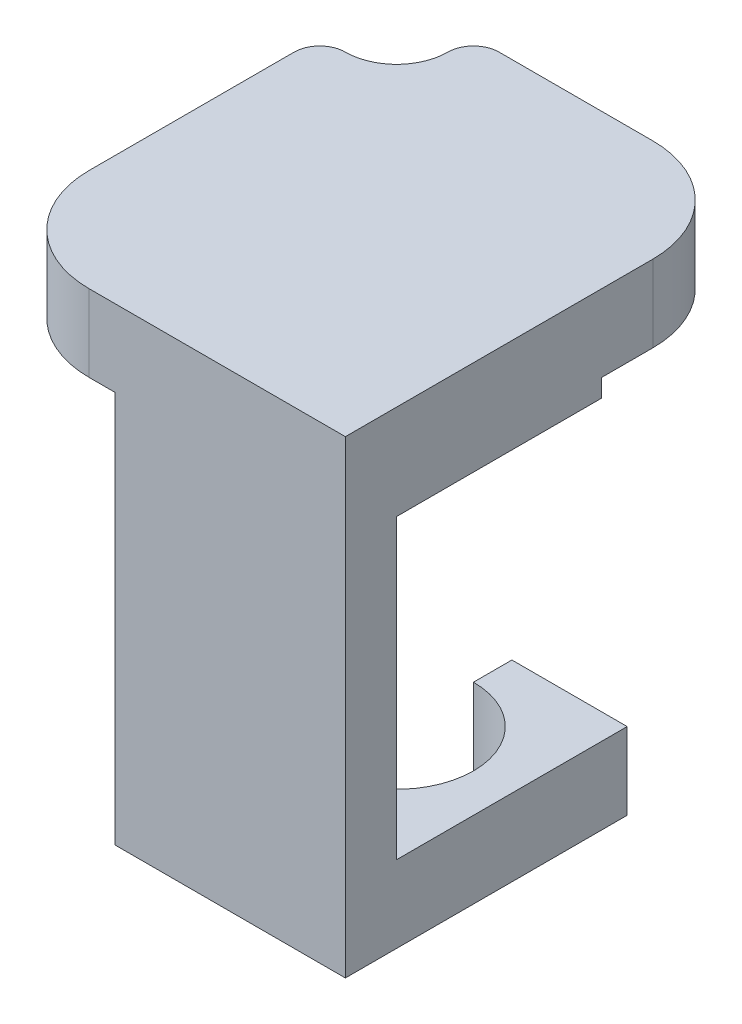
ISO-10303-21;
HEADER;
FILE_DESCRIPTION(('STEP AP214'),'2;1');
FILE_NAME('part.step','',(''),(''),'','','');
FILE_SCHEMA(('AUTOMOTIVE_DESIGN { 1 0 10303 214 1 1 1 1 }'));
ENDSEC;
DATA;
#1=APPLICATION_CONTEXT('core data for automotive mechanical design processes');
#2=APPLICATION_PROTOCOL_DEFINITION('international standard','automotive_design',2000,#1);
#3=PRODUCT_CONTEXT('',#1,'mechanical');
#4=PRODUCT('Part','Part','',(#3));
#5=PRODUCT_RELATED_PRODUCT_CATEGORY('part','',(#4));
#6=PRODUCT_DEFINITION_FORMATION('','',#4);
#7=PRODUCT_DEFINITION_CONTEXT('part definition',#1,'design');
#8=PRODUCT_DEFINITION('design','',#6,#7);
#9=PRODUCT_DEFINITION_SHAPE('','',#8);
#10=(LENGTH_UNIT() NAMED_UNIT(*) SI_UNIT(.MILLI.,.METRE.));
#11=(NAMED_UNIT(*) PLANE_ANGLE_UNIT() SI_UNIT($,.RADIAN.));
#12=(NAMED_UNIT(*) SI_UNIT($,.STERADIAN.) SOLID_ANGLE_UNIT());
#13=UNCERTAINTY_MEASURE_WITH_UNIT(LENGTH_MEASURE(1.E-05),#10,'distance_accuracy_value','');
#14=(GEOMETRIC_REPRESENTATION_CONTEXT(3) GLOBAL_UNCERTAINTY_ASSIGNED_CONTEXT((#13)) GLOBAL_UNIT_ASSIGNED_CONTEXT((#10,
#11,#12)) REPRESENTATION_CONTEXT('',''));
#15=CARTESIAN_POINT('',(0.,0.,0.));
#16=DIRECTION('',(0.,0.,1.));
#17=DIRECTION('',(1.,0.,0.));
#18=AXIS2_PLACEMENT_3D('',#15,#16,#17);
#19=CARTESIAN_POINT('',(0.,0.,-5.28410471378163));
#20=DIRECTION('',(0.,0.,-1.));
#21=DIRECTION('',(-1.,0.,0.));
#22=AXIS2_PLACEMENT_3D('',#19,#20,#21);
#23=PLANE('',#22);
#24=DIRECTION('',(0.,-1.,0.));
#25=VECTOR('',#24,1.);
#26=CARTESIAN_POINT('',(-13.3528439453228,-3.,-5.28410471378163));
#27=LINE('',#26,#25);
#28=CARTESIAN_POINT('',(-13.3528439453228,11.5999999999993,-5.28410471378163));
#29=VERTEX_POINT('',#28);
#30=CARTESIAN_POINT('',(-13.3528439453228,0.,-5.28410471378163));
#31=VERTEX_POINT('',#30);
#32=EDGE_CURVE('E254',#29,#31,#27,.T.);
#33=ORIENTED_EDGE('',*,*,#32,.F.);
#34=DIRECTION('',(-1.,0.,0.));
#35=VECTOR('',#34,1.);
#36=CARTESIAN_POINT('',(-4.35284394532278,11.5999999999993,-5.28410471378163));
#37=LINE('',#36,#35);
#38=CARTESIAN_POINT('',(-4.35284394532278,11.5999999999993,-5.28410471378163));
#39=VERTEX_POINT('',#38);
#40=EDGE_CURVE('E239',#39,#29,#37,.T.);
#41=ORIENTED_EDGE('',*,*,#40,.F.);
#42=DIRECTION('',(0.,1.,0.));
#43=VECTOR('',#42,1.);
#44=CARTESIAN_POINT('',(-4.35284394532278,-3.,-5.28410471378163));
#45=LINE('',#44,#43);
#46=CARTESIAN_POINT('',(-4.35284394532278,0.,-5.28410471378163));
#47=VERTEX_POINT('',#46);
#48=EDGE_CURVE('E259',#47,#39,#45,.T.);
#49=ORIENTED_EDGE('',*,*,#48,.F.);
#50=DIRECTION('',(1.,0.,0.));
#51=VECTOR('',#50,1.);
#52=CARTESIAN_POINT('',(-13.3528439453228,0.,-5.28410471378163));
#53=LINE('',#52,#51);
#54=EDGE_CURVE('E401',#31,#47,#53,.T.);
#55=ORIENTED_EDGE('',*,*,#54,.F.);
#56=EDGE_LOOP('',(#33,#41,#49,#55));
#57=FACE_BOUND('',#56,.T.);
#58=ADVANCED_FACE('F35',(#57),#23,.T.);
#59=CARTESIAN_POINT('',(-4.35284394532278,-3.,-14.2841047137816));
#60=DIRECTION('',(1.,0.,0.));
#61=DIRECTION('',(0.,0.,-1.));
#62=AXIS2_PLACEMENT_3D('',#59,#60,#61);
#63=PLANE('',#62);
#64=DIRECTION('',(0.,0.,-1.));
#65=VECTOR('',#64,1.);
#66=CARTESIAN_POINT('',(-4.35284394532278,12.3,-19.2841047137816));
#67=LINE('',#66,#65);
#68=CARTESIAN_POINT('',(-4.35284394532278,12.3,-13.2841047137816));
#69=VERTEX_POINT('',#68);
#70=CARTESIAN_POINT('',(-4.35284394532278,12.3,-15.2841047137816));
#71=VERTEX_POINT('',#70);
#72=EDGE_CURVE('E221',#69,#71,#67,.T.);
#73=ORIENTED_EDGE('',*,*,#72,.T.);
#74=DIRECTION('',(0.,1.,0.));
#75=VECTOR('',#74,1.);
#76=CARTESIAN_POINT('',(-4.35284394532278,-3.,-15.2841047137816));
#77=LINE('',#76,#75);
#78=CARTESIAN_POINT('',(-4.35284394532278,15.3,-15.2841047137816));
#79=VERTEX_POINT('',#78);
#80=EDGE_CURVE('E280',#71,#79,#77,.T.);
#81=ORIENTED_EDGE('',*,*,#80,.T.);
#82=DIRECTION('',(0.,0.,-1.));
#83=VECTOR('',#82,1.);
#84=CARTESIAN_POINT('',(-4.35284394532278,15.3,-3.28410471378163));
#85=LINE('',#84,#83);
#86=CARTESIAN_POINT('',(-4.35284394532278,15.3,-3.28410471378163));
#87=VERTEX_POINT('',#86);
#88=EDGE_CURVE('E267',#87,#79,#85,.T.);
#89=ORIENTED_EDGE('',*,*,#88,.F.);
#90=DIRECTION('',(0.,1.,0.));
#91=VECTOR('',#90,1.);
#92=CARTESIAN_POINT('',(-4.35284394532278,-3.,-3.28410471378163));
#93=LINE('',#92,#91);
#94=CARTESIAN_POINT('',(-4.35284394532278,-3.,-3.28410471378163));
#95=VERTEX_POINT('',#94);
#96=EDGE_CURVE('E261',#95,#87,#93,.T.);
#97=ORIENTED_EDGE('',*,*,#96,.F.);
#98=DIRECTION('',(0.,0.,-1.));
#99=VECTOR('',#98,1.);
#100=CARTESIAN_POINT('',(-4.35284394532278,-3.,-14.2841047137816));
#101=LINE('',#100,#99);
#102=CARTESIAN_POINT('',(-4.35284394532278,-3.,-14.2841047137816));
#103=VERTEX_POINT('',#102);
#104=EDGE_CURVE('E397',#95,#103,#101,.T.);
#105=ORIENTED_EDGE('',*,*,#104,.T.);
#106=DIRECTION('',(0.,1.,0.));
#107=VECTOR('',#106,1.);
#108=CARTESIAN_POINT('',(-4.35284394532278,-3.,-14.2841047137816));
#109=LINE('',#108,#107);
#110=CARTESIAN_POINT('',(-4.35284394532278,0.,-14.2841047137816));
#111=VERTEX_POINT('',#110);
#112=EDGE_CURVE('E281',#103,#111,#109,.T.);
#113=ORIENTED_EDGE('',*,*,#112,.T.);
#114=DIRECTION('',(0.,0.,-1.));
#115=VECTOR('',#114,1.);
#116=CARTESIAN_POINT('',(-4.35284394532278,0.,-14.2841047137816));
#117=LINE('',#116,#115);
#118=EDGE_CURVE('E389',#47,#111,#117,.T.);
#119=ORIENTED_EDGE('',*,*,#118,.F.);
#120=ORIENTED_EDGE('',*,*,#48,.T.);
#121=DIRECTION('',(0.,0.,1.));
#122=VECTOR('',#121,1.);
#123=CARTESIAN_POINT('',(-4.35284394532278,11.5999999999993,-13.2841047137816));
#124=LINE('',#123,#122);
#125=CARTESIAN_POINT('',(-4.35284394532278,11.5999999999993,-13.2841047137816));
#126=VERTEX_POINT('',#125);
#127=EDGE_CURVE('E252',#126,#39,#124,.T.);
#128=ORIENTED_EDGE('',*,*,#127,.F.);
#129=DIRECTION('',(0.,-1.,0.));
#130=VECTOR('',#129,1.);
#131=CARTESIAN_POINT('',(-4.35284394532278,15.3,-13.2841047137816));
#132=LINE('',#131,#130);
#133=EDGE_CURVE('E240',#69,#126,#132,.T.);
#134=ORIENTED_EDGE('',*,*,#133,.F.);
#135=EDGE_LOOP('',(#73,#81,#89,#97,#105,#113,#119,#120,#128,#134));
#136=FACE_BOUND('',#135,.T.);
#137=ADVANCED_FACE('F353',(#136),#63,.T.);
#138=CARTESIAN_POINT('',(-13.3528439453228,-3.,-14.2841047137816));
#139=DIRECTION('',(-1.,0.,0.));
#140=DIRECTION('',(0.,0.,1.));
#141=AXIS2_PLACEMENT_3D('',#138,#139,#140);
#142=PLANE('',#141);
#143=DIRECTION('',(0.,0.,1.));
#144=VECTOR('',#143,1.);
#145=CARTESIAN_POINT('',(-13.3528439453228,12.3,-14.2841047137816));
#146=LINE('',#145,#144);
#147=CARTESIAN_POINT('',(-13.3528439453228,12.3,-13.2841047137816));
#148=VERTEX_POINT('',#147);
#149=CARTESIAN_POINT('',(-13.3528439453228,12.3,-3.28410471378163));
#150=VERTEX_POINT('',#149);
#151=EDGE_CURVE('E202',#148,#150,#146,.T.);
#152=ORIENTED_EDGE('',*,*,#151,.F.);
#153=DIRECTION('',(0.,-1.,0.));
#154=VECTOR('',#153,1.);
#155=CARTESIAN_POINT('',(-13.3528439453228,15.3,-13.2841047137816));
#156=LINE('',#155,#154);
#157=CARTESIAN_POINT('',(-13.3528439453228,11.5999999999993,-13.2841047137816));
#158=VERTEX_POINT('',#157);
#159=EDGE_CURVE('E245',#148,#158,#156,.T.);
#160=ORIENTED_EDGE('',*,*,#159,.T.);
#161=DIRECTION('',(0.,0.,1.));
#162=VECTOR('',#161,1.);
#163=CARTESIAN_POINT('',(-13.3528439453228,11.5999999999993,-13.2841047137816));
#164=LINE('',#163,#162);
#165=EDGE_CURVE('E248',#158,#29,#164,.T.);
#166=ORIENTED_EDGE('',*,*,#165,.T.);
#167=ORIENTED_EDGE('',*,*,#32,.T.);
#168=DIRECTION('',(0.,0.,1.));
#169=VECTOR('',#168,1.);
#170=CARTESIAN_POINT('',(-13.3528439453228,0.,-14.2841047137816));
#171=LINE('',#170,#169);
#172=CARTESIAN_POINT('',(-13.3528439453228,0.,-9.78410471378163));
#173=VERTEX_POINT('',#172);
#174=EDGE_CURVE('E409',#173,#31,#171,.T.);
#175=ORIENTED_EDGE('',*,*,#174,.F.);
#176=DIRECTION('',(0.,-1.,0.));
#177=VECTOR('',#176,1.);
#178=CARTESIAN_POINT('',(-13.3528439453228,0.,-9.78410471378163));
#179=LINE('',#178,#177);
#180=CARTESIAN_POINT('',(-13.3528439453228,-3.,-9.78410471378163));
#181=VERTEX_POINT('',#180);
#182=EDGE_CURVE('E393',#173,#181,#179,.T.);
#183=ORIENTED_EDGE('',*,*,#182,.T.);
#184=DIRECTION('',(0.,0.,1.));
#185=VECTOR('',#184,1.);
#186=CARTESIAN_POINT('',(-13.3528439453228,-3.,-14.2841047137816));
#187=LINE('',#186,#185);
#188=CARTESIAN_POINT('',(-13.3528439453228,-3.,-3.28410471378163));
#189=VERTEX_POINT('',#188);
#190=EDGE_CURVE('E404',#181,#189,#187,.T.);
#191=ORIENTED_EDGE('',*,*,#190,.T.);
#192=DIRECTION('',(0.,-1.,0.));
#193=VECTOR('',#192,1.);
#194=CARTESIAN_POINT('',(-13.3528439453228,-3.,-3.28410471378163));
#195=LINE('',#194,#193);
#196=EDGE_CURVE('E255',#150,#189,#195,.T.);
#197=ORIENTED_EDGE('',*,*,#196,.F.);
#198=EDGE_LOOP('',(#152,#160,#166,#167,#175,#183,#191,#197));
#199=FACE_BOUND('',#198,.T.);
#200=ADVANCED_FACE('F363',(#199),#142,.T.);
#201=CARTESIAN_POINT('',(-13.3528439453228,-3.,-14.2841047137816));
#202=DIRECTION('',(0.,0.,-1.));
#203=DIRECTION('',(-1.,0.,0.));
#204=AXIS2_PLACEMENT_3D('',#201,#202,#203);
#205=PLANE('',#204);
#206=DIRECTION('',(0.,-1.,0.));
#207=VECTOR('',#206,1.);
#208=CARTESIAN_POINT('',(-8.85284394532278,0.,-14.2841047137816));
#209=LINE('',#208,#207);
#210=CARTESIAN_POINT('',(-8.85284394532278,0.,-14.2841047137816));
#211=VERTEX_POINT('',#210);
#212=CARTESIAN_POINT('',(-8.85284394532278,-3.,-14.2841047137816));
#213=VERTEX_POINT('',#212);
#214=EDGE_CURVE('E390',#211,#213,#209,.T.);
#215=ORIENTED_EDGE('',*,*,#214,.F.);
#216=DIRECTION('',(-1.,0.,0.));
#217=VECTOR('',#216,1.);
#218=CARTESIAN_POINT('',(-13.3528439453228,0.,-14.2841047137816));
#219=LINE('',#218,#217);
#220=EDGE_CURVE('E406',#111,#211,#219,.T.);
#221=ORIENTED_EDGE('',*,*,#220,.F.);
#222=ORIENTED_EDGE('',*,*,#112,.F.);
#223=DIRECTION('',(-1.,0.,0.));
#224=VECTOR('',#223,1.);
#225=CARTESIAN_POINT('',(-13.3528439453228,-3.,-14.2841047137816));
#226=LINE('',#225,#224);
#227=EDGE_CURVE('E400',#103,#213,#226,.T.);
#228=ORIENTED_EDGE('',*,*,#227,.T.);
#229=EDGE_LOOP('',(#215,#221,#222,#228));
#230=FACE_BOUND('',#229,.T.);
#231=ADVANCED_FACE('F434',(#230),#205,.T.);
#232=CARTESIAN_POINT('',(0.,-3.,0.));
#233=DIRECTION('',(0.,1.,0.));
#234=DIRECTION('',(0.,0.,1.));
#235=AXIS2_PLACEMENT_3D('',#232,#233,#234);
#236=PLANE('',#235);
#237=CARTESIAN_POINT('',(-8.85284394532278,-3.,-9.78410471378163));
#238=DIRECTION('',(0.,-1.,0.));
#239=DIRECTION('',(0.,0.,-1.));
#240=AXIS2_PLACEMENT_3D('',#237,#238,#239);
#241=CIRCLE('',#240,3.);
#242=CARTESIAN_POINT('',(-8.85284394532278,-3.,-12.7841047137816));
#243=VERTEX_POINT('',#242);
#244=CARTESIAN_POINT('',(-11.8528439453228,-3.,-9.78410471378163));
#245=VERTEX_POINT('',#244);
#246=EDGE_CURVE('E368',#243,#245,#241,.T.);
#247=ORIENTED_EDGE('',*,*,#246,.F.);
#248=DIRECTION('',(0.,0.,1.));
#249=VECTOR('',#248,1.);
#250=CARTESIAN_POINT('',(-8.85284394532278,-3.,-12.7841047137816));
#251=LINE('',#250,#249);
#252=EDGE_CURVE('E378',#213,#243,#251,.T.);
#253=ORIENTED_EDGE('',*,*,#252,.F.);
#254=ORIENTED_EDGE('',*,*,#227,.F.);
#255=ORIENTED_EDGE('',*,*,#104,.F.);
#256=DIRECTION('',(1.,0.,0.));
#257=VECTOR('',#256,1.);
#258=CARTESIAN_POINT('',(-13.3528439453228,-3.,-3.28410471378163));
#259=LINE('',#258,#257);
#260=EDGE_CURVE('E258',#189,#95,#259,.T.);
#261=ORIENTED_EDGE('',*,*,#260,.F.);
#262=ORIENTED_EDGE('',*,*,#190,.F.);
#263=DIRECTION('',(-1.,0.,0.));
#264=VECTOR('',#263,1.);
#265=CARTESIAN_POINT('',(-13.3528439453228,-3.,-9.78410471378163));
#266=LINE('',#265,#264);
#267=EDGE_CURVE('E370',#245,#181,#266,.T.);
#268=ORIENTED_EDGE('',*,*,#267,.F.);
#269=EDGE_LOOP('',(#247,#253,#254,#255,#261,#262,#268));
#270=FACE_BOUND('',#269,.T.);
#271=ADVANCED_FACE('F446',(#270),#236,.F.);
#272=CARTESIAN_POINT('',(0.,0.,0.));
#273=DIRECTION('',(0.,1.,0.));
#274=DIRECTION('',(0.,0.,1.));
#275=AXIS2_PLACEMENT_3D('',#272,#273,#274);
#276=PLANE('',#275);
#277=DIRECTION('',(0.,0.,1.));
#278=VECTOR('',#277,1.);
#279=CARTESIAN_POINT('',(-8.85284394532278,0.,-12.7841047137816));
#280=LINE('',#279,#278);
#281=CARTESIAN_POINT('',(-8.85284394532278,0.,-12.7841047137816));
#282=VERTEX_POINT('',#281);
#283=EDGE_CURVE('E380',#211,#282,#280,.T.);
#284=ORIENTED_EDGE('',*,*,#283,.T.);
#285=CARTESIAN_POINT('',(-8.85284394532278,0.,-9.78410471378163));
#286=DIRECTION('',(0.,-1.,0.));
#287=DIRECTION('',(0.,0.,-1.));
#288=AXIS2_PLACEMENT_3D('',#285,#286,#287);
#289=CIRCLE('',#288,3.);
#290=CARTESIAN_POINT('',(-11.8528439453228,0.,-9.78410471378163));
#291=VERTEX_POINT('',#290);
#292=EDGE_CURVE('E374',#282,#291,#289,.T.);
#293=ORIENTED_EDGE('',*,*,#292,.T.);
#294=DIRECTION('',(-1.,0.,0.));
#295=VECTOR('',#294,1.);
#296=CARTESIAN_POINT('',(-13.3528439453228,0.,-9.78410471378163));
#297=LINE('',#296,#295);
#298=EDGE_CURVE('E377',#291,#173,#297,.T.);
#299=ORIENTED_EDGE('',*,*,#298,.T.);
#300=ORIENTED_EDGE('',*,*,#174,.T.);
#301=ORIENTED_EDGE('',*,*,#54,.T.);
#302=ORIENTED_EDGE('',*,*,#118,.T.);
#303=ORIENTED_EDGE('',*,*,#220,.T.);
#304=EDGE_LOOP('',(#284,#293,#299,#300,#301,#302,#303));
#305=FACE_BOUND('',#304,.T.);
#306=ADVANCED_FACE('F420',(#305),#276,.T.);
#307=CARTESIAN_POINT('',(-8.85284394532278,0.,-9.78410471378163));
#308=DIRECTION('',(0.,-1.,0.));
#309=DIRECTION('',(0.,0.,-1.));
#310=AXIS2_PLACEMENT_3D('',#307,#308,#309);
#311=CYLINDRICAL_SURFACE('',#310,3.);
#312=ORIENTED_EDGE('',*,*,#246,.T.);
#313=DIRECTION('',(0.,-1.,0.));
#314=VECTOR('',#313,1.);
#315=CARTESIAN_POINT('',(-11.8528439453228,0.,-9.78410471378163));
#316=LINE('',#315,#314);
#317=EDGE_CURVE('E382',#291,#245,#316,.T.);
#318=ORIENTED_EDGE('',*,*,#317,.F.);
#319=ORIENTED_EDGE('',*,*,#292,.F.);
#320=DIRECTION('',(0.,-1.,0.));
#321=VECTOR('',#320,1.);
#322=CARTESIAN_POINT('',(-8.85284394532278,0.,-12.7841047137816));
#323=LINE('',#322,#321);
#324=EDGE_CURVE('E387',#282,#243,#323,.T.);
#325=ORIENTED_EDGE('',*,*,#324,.T.);
#326=EDGE_LOOP('',(#312,#318,#319,#325));
#327=FACE_BOUND('',#326,.T.);
#328=ADVANCED_FACE('F440',(#327),#311,.F.);
#329=CARTESIAN_POINT('',(-8.85284394532278,0.,-12.7841047137816));
#330=DIRECTION('',(1.,0.,0.));
#331=DIRECTION('',(0.,0.,-1.));
#332=AXIS2_PLACEMENT_3D('',#329,#330,#331);
#333=PLANE('',#332);
#334=ORIENTED_EDGE('',*,*,#252,.T.);
#335=ORIENTED_EDGE('',*,*,#324,.F.);
#336=ORIENTED_EDGE('',*,*,#283,.F.);
#337=ORIENTED_EDGE('',*,*,#214,.T.);
#338=EDGE_LOOP('',(#334,#335,#336,#337));
#339=FACE_BOUND('',#338,.T.);
#340=ADVANCED_FACE('F436',(#339),#333,.F.);
#341=CARTESIAN_POINT('',(-13.3528439453228,0.,-9.78410471378163));
#342=DIRECTION('',(0.,0.,1.));
#343=DIRECTION('',(1.,0.,0.));
#344=AXIS2_PLACEMENT_3D('',#341,#342,#343);
#345=PLANE('',#344);
#346=ORIENTED_EDGE('',*,*,#267,.T.);
#347=ORIENTED_EDGE('',*,*,#182,.F.);
#348=ORIENTED_EDGE('',*,*,#298,.F.);
#349=ORIENTED_EDGE('',*,*,#317,.T.);
#350=EDGE_LOOP('',(#346,#347,#348,#349));
#351=FACE_BOUND('',#350,.T.);
#352=ADVANCED_FACE('F443',(#351),#345,.F.);
#353=CARTESIAN_POINT('',(-13.3528439453228,15.3,-3.28410471378163));
#354=DIRECTION('',(0.,-1.,0.));
#355=DIRECTION('',(0.,0.,-1.));
#356=AXIS2_PLACEMENT_3D('',#353,#354,#355);
#357=PLANE('',#356);
#358=DIRECTION('',(-1.,0.,0.));
#359=VECTOR('',#358,1.);
#360=CARTESIAN_POINT('',(-13.3528439453207,15.3,-19.2841047137816));
#361=LINE('',#360,#359);
#362=CARTESIAN_POINT('',(-8.35284394532278,15.3,-19.2841047137816));
#363=VERTEX_POINT('',#362);
#364=CARTESIAN_POINT('',(-14.3528439453207,15.3,-19.2841047137816));
#365=VERTEX_POINT('',#364);
#366=EDGE_CURVE('E219',#363,#365,#361,.T.);
#367=ORIENTED_EDGE('',*,*,#366,.T.);
#368=CARTESIAN_POINT('',(-14.3528439453207,15.3,-18.2841047137816));
#369=DIRECTION('',(0.,-1.,0.));
#370=DIRECTION('',(0.,0.,-1.));
#371=AXIS2_PLACEMENT_3D('',#368,#369,#370);
#372=CIRCLE('',#371,1.);
#373=CARTESIAN_POINT('',(-15.3528439453207,15.3,-18.2841047137844));
#374=VERTEX_POINT('',#373);
#375=EDGE_CURVE('E316',#365,#374,#372,.F.);
#376=ORIENTED_EDGE('',*,*,#375,.T.);
#377=CARTESIAN_POINT('',(-17.3528439453207,15.3,-18.2841047137844));
#378=DIRECTION('',(0.,-1.,0.));
#379=DIRECTION('',(0.,0.,-1.));
#380=AXIS2_PLACEMENT_3D('',#377,#378,#379);
#381=CIRCLE('',#380,2.);
#382=CARTESIAN_POINT('',(-17.3528439453207,15.3,-16.2841047137844));
#383=VERTEX_POINT('',#382);
#384=EDGE_CURVE('E306',#374,#383,#381,.T.);
#385=ORIENTED_EDGE('',*,*,#384,.T.);
#386=CARTESIAN_POINT('',(-17.3528439453228,15.3,-15.2841047137844));
#387=DIRECTION('',(0.,-1.,0.));
#388=DIRECTION('',(0.,0.,-1.));
#389=AXIS2_PLACEMENT_3D('',#386,#387,#388);
#390=CIRCLE('',#389,1.);
#391=CARTESIAN_POINT('',(-18.3528439453228,15.3,-15.2841047137844));
#392=VERTEX_POINT('',#391);
#393=EDGE_CURVE('E313',#383,#392,#390,.F.);
#394=ORIENTED_EDGE('',*,*,#393,.T.);
#395=DIRECTION('',(0.,0.,1.));
#396=VECTOR('',#395,1.);
#397=CARTESIAN_POINT('',(-18.3528439453228,15.3,-3.28410471378163));
#398=LINE('',#397,#396);
#399=CARTESIAN_POINT('',(-18.3528439453228,15.3,-7.28410471378163));
#400=VERTEX_POINT('',#399);
#401=EDGE_CURVE('E192',#392,#400,#398,.T.);
#402=ORIENTED_EDGE('',*,*,#401,.T.);
#403=CARTESIAN_POINT('',(-14.3528439453228,15.3,-7.28410471378163));
#404=DIRECTION('',(0.,-1.,0.));
#405=DIRECTION('',(0.,0.,-1.));
#406=AXIS2_PLACEMENT_3D('',#403,#404,#405);
#407=CIRCLE('',#406,4.);
#408=CARTESIAN_POINT('',(-14.3528439453228,15.3,-3.28410471378163));
#409=VERTEX_POINT('',#408);
#410=EDGE_CURVE('E284',#400,#409,#407,.F.);
#411=ORIENTED_EDGE('',*,*,#410,.T.);
#412=DIRECTION('',(-1.,0.,0.));
#413=VECTOR('',#412,1.);
#414=CARTESIAN_POINT('',(-13.3528439453228,15.3,-3.28410471378163));
#415=LINE('',#414,#413);
#416=EDGE_CURVE('E264',#87,#409,#415,.T.);
#417=ORIENTED_EDGE('',*,*,#416,.F.);
#418=ORIENTED_EDGE('',*,*,#88,.T.);
#419=CARTESIAN_POINT('',(-8.35284394532278,15.3,-15.2841047137816));
#420=DIRECTION('',(0.,-1.,0.));
#421=DIRECTION('',(0.,0.,-1.));
#422=AXIS2_PLACEMENT_3D('',#419,#420,#421);
#423=CIRCLE('',#422,4.);
#424=EDGE_CURVE('E287',#79,#363,#423,.F.);
#425=ORIENTED_EDGE('',*,*,#424,.T.);
#426=EDGE_LOOP('',(#367,#376,#385,#394,#402,#411,#417,#418,#425));
#427=FACE_BOUND('',#426,.T.);
#428=ADVANCED_FACE('F341',(#427),#357,.F.);
#429=CARTESIAN_POINT('',(0.,0.,-3.28410471378163));
#430=DIRECTION('',(0.,0.,-1.));
#431=DIRECTION('',(-1.,0.,0.));
#432=AXIS2_PLACEMENT_3D('',#429,#430,#431);
#433=PLANE('',#432);
#434=ORIENTED_EDGE('',*,*,#416,.T.);
#435=DIRECTION('',(0.,1.,0.));
#436=VECTOR('',#435,1.);
#437=CARTESIAN_POINT('',(-14.3528439453228,12.3,-3.28410471378163));
#438=LINE('',#437,#436);
#439=CARTESIAN_POINT('',(-14.3528439453228,12.3,-3.28410471378163));
#440=VERTEX_POINT('',#439);
#441=EDGE_CURVE('E299',#409,#440,#438,.F.);
#442=ORIENTED_EDGE('',*,*,#441,.T.);
#443=DIRECTION('',(1.,0.,0.));
#444=VECTOR('',#443,1.);
#445=CARTESIAN_POINT('',(-18.3528439453228,12.3,-3.28410471378163));
#446=LINE('',#445,#444);
#447=EDGE_CURVE('E218',#440,#150,#446,.T.);
#448=ORIENTED_EDGE('',*,*,#447,.T.);
#449=ORIENTED_EDGE('',*,*,#196,.T.);
#450=ORIENTED_EDGE('',*,*,#260,.T.);
#451=ORIENTED_EDGE('',*,*,#96,.T.);
#452=EDGE_LOOP('',(#434,#442,#448,#449,#450,#451));
#453=FACE_BOUND('',#452,.T.);
#454=ADVANCED_FACE('F366',(#453),#433,.F.);
#455=CARTESIAN_POINT('',(-4.35284394532278,11.5999999999993,-13.2841047137816));
#456=DIRECTION('',(0.,1.,0.));
#457=DIRECTION('',(0.,0.,1.));
#458=AXIS2_PLACEMENT_3D('',#455,#456,#457);
#459=PLANE('',#458);
#460=CARTESIAN_POINT('',(-8.85284394532278,11.5999999999993,-9.78410471378163));
#461=DIRECTION('',(0.,-1.,0.));
#462=DIRECTION('',(0.,0.,-1.));
#463=AXIS2_PLACEMENT_3D('',#460,#461,#462);
#464=CIRCLE('',#463,1.32996856805454);
#465=CARTESIAN_POINT('',(-8.85284394532278,11.5999999999993,-11.1140732818362));
#466=VERTEX_POINT('',#465);
#467=EDGE_CURVE('E213',#466,#466,#464,.T.);
#468=ORIENTED_EDGE('',*,*,#467,.F.);
#469=EDGE_LOOP('',(#468));
#470=FACE_BOUND('',#469,.T.);
#471=ORIENTED_EDGE('',*,*,#40,.T.);
#472=ORIENTED_EDGE('',*,*,#165,.F.);
#473=DIRECTION('',(-1.,0.,0.));
#474=VECTOR('',#473,1.);
#475=CARTESIAN_POINT('',(-4.35284394532278,11.5999999999993,-13.2841047137816));
#476=LINE('',#475,#474);
#477=EDGE_CURVE('E243',#126,#158,#476,.T.);
#478=ORIENTED_EDGE('',*,*,#477,.F.);
#479=ORIENTED_EDGE('',*,*,#127,.T.);
#480=EDGE_LOOP('',(#471,#472,#478,#479));
#481=FACE_BOUND('',#480,.T.);
#482=ADVANCED_FACE('F429',(#470,#481),#459,.F.);
#483=CARTESIAN_POINT('',(0.,0.,-13.2841047137816));
#484=DIRECTION('',(0.,0.,-1.));
#485=DIRECTION('',(-1.,0.,0.));
#486=AXIS2_PLACEMENT_3D('',#483,#484,#485);
#487=PLANE('',#486);
#488=DIRECTION('',(-1.,0.,0.));
#489=VECTOR('',#488,1.);
#490=CARTESIAN_POINT('',(0.,12.3,-13.2841047137816));
#491=LINE('',#490,#489);
#492=EDGE_CURVE('E278',#69,#148,#491,.T.);
#493=ORIENTED_EDGE('',*,*,#492,.F.);
#494=ORIENTED_EDGE('',*,*,#133,.T.);
#495=ORIENTED_EDGE('',*,*,#477,.T.);
#496=ORIENTED_EDGE('',*,*,#159,.F.);
#497=EDGE_LOOP('',(#493,#494,#495,#496));
#498=FACE_BOUND('',#497,.T.);
#499=ADVANCED_FACE('F358',(#498),#487,.T.);
#500=CARTESIAN_POINT('',(-18.3528439453228,12.3,-3.28410471378163));
#501=DIRECTION('',(-1.,0.,0.));
#502=DIRECTION('',(0.,0.,1.));
#503=AXIS2_PLACEMENT_3D('',#500,#501,#502);
#504=PLANE('',#503);
#505=ORIENTED_EDGE('',*,*,#401,.F.);
#506=DIRECTION('',(0.,1.,0.));
#507=VECTOR('',#506,1.);
#508=CARTESIAN_POINT('',(-18.3528439453228,12.3,-15.2841047137844));
#509=LINE('',#508,#507);
#510=CARTESIAN_POINT('',(-18.3528439453228,14.3,-15.2841047137844));
#511=VERTEX_POINT('',#510);
#512=EDGE_CURVE('E11',#392,#511,#509,.F.);
#513=ORIENTED_EDGE('',*,*,#512,.T.);
#514=DIRECTION('',(0.,0.,1.));
#515=VECTOR('',#514,1.);
#516=CARTESIAN_POINT('',(-18.3528439453228,14.3,-16.2841047137844));
#517=LINE('',#516,#515);
#518=CARTESIAN_POINT('',(-18.3528439453228,14.3,-14.2841047137844));
#519=VERTEX_POINT('',#518);
#520=EDGE_CURVE('E186',#511,#519,#517,.T.);
#521=ORIENTED_EDGE('',*,*,#520,.T.);
#522=DIRECTION('',(0.,1.,0.));
#523=VECTOR('',#522,1.);
#524=CARTESIAN_POINT('',(-18.3528439453228,12.3,-14.2841047137844));
#525=LINE('',#524,#523);
#526=CARTESIAN_POINT('',(-18.3528439453228,12.3,-14.2841047137844));
#527=VERTEX_POINT('',#526);
#528=EDGE_CURVE('E195',#527,#519,#525,.T.);
#529=ORIENTED_EDGE('',*,*,#528,.F.);
#530=DIRECTION('',(0.,0.,1.));
#531=VECTOR('',#530,1.);
#532=CARTESIAN_POINT('',(-18.3528439453228,12.3,-3.28410471378163));
#533=LINE('',#532,#531);
#534=CARTESIAN_POINT('',(-18.3528439453228,12.3,-7.28410471378163));
#535=VERTEX_POINT('',#534);
#536=EDGE_CURVE('E216',#527,#535,#533,.T.);
#537=ORIENTED_EDGE('',*,*,#536,.T.);
#538=DIRECTION('',(0.,1.,0.));
#539=VECTOR('',#538,1.);
#540=CARTESIAN_POINT('',(-18.3528439453228,15.3,-7.28410471378163));
#541=LINE('',#540,#539);
#542=EDGE_CURVE('E297',#535,#400,#541,.T.);
#543=ORIENTED_EDGE('',*,*,#542,.T.);
#544=EDGE_LOOP('',(#505,#513,#521,#529,#537,#543));
#545=FACE_BOUND('',#544,.T.);
#546=ADVANCED_FACE('F205',(#545),#504,.T.);
#547=CARTESIAN_POINT('',(-18.3528439453228,12.3,-14.2841047137844));
#548=DIRECTION('',(0.,0.,-1.));
#549=DIRECTION('',(-1.,0.,0.));
#550=AXIS2_PLACEMENT_3D('',#547,#548,#549);
#551=PLANE('',#550);
#552=DIRECTION('',(-1.,0.,0.));
#553=VECTOR('',#552,1.);
#554=CARTESIAN_POINT('',(-18.3528439453228,14.3,-14.2841047137844));
#555=LINE('',#554,#553);
#556=CARTESIAN_POINT('',(-13.3528439453207,14.3,-14.2841047137844));
#557=VERTEX_POINT('',#556);
#558=EDGE_CURVE('E181',#557,#519,#555,.T.);
#559=ORIENTED_EDGE('',*,*,#558,.F.);
#560=DIRECTION('',(0.,1.,0.));
#561=VECTOR('',#560,1.);
#562=CARTESIAN_POINT('',(-13.3528439453207,12.3,-14.2841047137844));
#563=LINE('',#562,#561);
#564=CARTESIAN_POINT('',(-13.3528439453207,12.3,-14.2841047137844));
#565=VERTEX_POINT('',#564);
#566=EDGE_CURVE('E203',#565,#557,#563,.T.);
#567=ORIENTED_EDGE('',*,*,#566,.F.);
#568=DIRECTION('',(-1.,0.,0.));
#569=VECTOR('',#568,1.);
#570=CARTESIAN_POINT('',(-18.3528439453228,12.3,-14.2841047137844));
#571=LINE('',#570,#569);
#572=EDGE_CURVE('E198',#565,#527,#571,.T.);
#573=ORIENTED_EDGE('',*,*,#572,.T.);
#574=ORIENTED_EDGE('',*,*,#528,.T.);
#575=EDGE_LOOP('',(#559,#567,#573,#574));
#576=FACE_BOUND('',#575,.T.);
#577=ADVANCED_FACE('F196',(#576),#551,.T.);
#578=CARTESIAN_POINT('',(-13.3528439453207,12.3,-14.2841047137844));
#579=DIRECTION('',(-1.,0.,0.));
#580=DIRECTION('',(0.,0.,1.));
#581=AXIS2_PLACEMENT_3D('',#578,#579,#580);
#582=PLANE('',#581);
#583=DIRECTION('',(0.,0.,1.));
#584=VECTOR('',#583,1.);
#585=CARTESIAN_POINT('',(-13.3528439453207,14.3,-14.2841047137844));
#586=LINE('',#585,#584);
#587=CARTESIAN_POINT('',(-13.3528439453207,14.3,-19.2841047137816));
#588=VERTEX_POINT('',#587);
#589=EDGE_CURVE('E188',#588,#557,#586,.T.);
#590=ORIENTED_EDGE('',*,*,#589,.F.);
#591=DIRECTION('',(0.,1.,0.));
#592=VECTOR('',#591,1.);
#593=CARTESIAN_POINT('',(-13.3528439453207,12.3,-19.2841047137816));
#594=LINE('',#593,#592);
#595=CARTESIAN_POINT('',(-13.3528439453207,12.3,-19.2841047137816));
#596=VERTEX_POINT('',#595);
#597=EDGE_CURVE('E229',#596,#588,#594,.T.);
#598=ORIENTED_EDGE('',*,*,#597,.F.);
#599=DIRECTION('',(0.,0.,1.));
#600=VECTOR('',#599,1.);
#601=CARTESIAN_POINT('',(-13.3528439453207,12.3,-14.2841047137844));
#602=LINE('',#601,#600);
#603=EDGE_CURVE('E226',#596,#565,#602,.T.);
#604=ORIENTED_EDGE('',*,*,#603,.T.);
#605=ORIENTED_EDGE('',*,*,#566,.T.);
#606=EDGE_LOOP('',(#590,#598,#604,#605));
#607=FACE_BOUND('',#606,.T.);
#608=ADVANCED_FACE('F332',(#607),#582,.T.);
#609=CARTESIAN_POINT('',(-13.3528439453207,12.3,-19.2841047137816));
#610=DIRECTION('',(0.,0.,-1.));
#611=DIRECTION('',(-1.,0.,0.));
#612=AXIS2_PLACEMENT_3D('',#609,#610,#611);
#613=PLANE('',#612);
#614=DIRECTION('',(-1.,0.,0.));
#615=VECTOR('',#614,1.);
#616=CARTESIAN_POINT('',(-4.35284394532278,14.3,-19.2841047137816));
#617=LINE('',#616,#615);
#618=CARTESIAN_POINT('',(-14.3528439453207,14.3,-19.2841047137816));
#619=VERTEX_POINT('',#618);
#620=EDGE_CURVE('E206',#588,#619,#617,.T.);
#621=ORIENTED_EDGE('',*,*,#620,.T.);
#622=DIRECTION('',(0.,1.,0.));
#623=VECTOR('',#622,1.);
#624=CARTESIAN_POINT('',(-14.3528439453207,12.3,-19.2841047137816));
#625=LINE('',#624,#623);
#626=EDGE_CURVE('E311',#619,#365,#625,.T.);
#627=ORIENTED_EDGE('',*,*,#626,.T.);
#628=ORIENTED_EDGE('',*,*,#366,.F.);
#629=DIRECTION('',(0.,1.,0.));
#630=VECTOR('',#629,1.);
#631=CARTESIAN_POINT('',(-8.35284394532278,12.3,-19.2841047137816));
#632=LINE('',#631,#630);
#633=CARTESIAN_POINT('',(-8.35284394532278,12.3,-19.2841047137816));
#634=VERTEX_POINT('',#633);
#635=EDGE_CURVE('E290',#363,#634,#632,.F.);
#636=ORIENTED_EDGE('',*,*,#635,.T.);
#637=DIRECTION('',(-1.,0.,0.));
#638=VECTOR('',#637,1.);
#639=CARTESIAN_POINT('',(-13.3528439453207,12.3,-19.2841047137816));
#640=LINE('',#639,#638);
#641=EDGE_CURVE('E224',#634,#596,#640,.T.);
#642=ORIENTED_EDGE('',*,*,#641,.T.);
#643=ORIENTED_EDGE('',*,*,#597,.T.);
#644=EDGE_LOOP('',(#621,#627,#628,#636,#642,#643));
#645=FACE_BOUND('',#644,.T.);
#646=ADVANCED_FACE('F327',(#645),#613,.T.);
#647=CARTESIAN_POINT('',(0.,12.3,0.));
#648=DIRECTION('',(0.,-1.,0.));
#649=DIRECTION('',(0.,0.,-1.));
#650=AXIS2_PLACEMENT_3D('',#647,#648,#649);
#651=PLANE('',#650);
#652=ORIENTED_EDGE('',*,*,#641,.F.);
#653=CARTESIAN_POINT('',(-8.35284394532278,12.3,-15.2841047137816));
#654=DIRECTION('',(0.,-1.,0.));
#655=DIRECTION('',(0.,0.,-1.));
#656=AXIS2_PLACEMENT_3D('',#653,#654,#655);
#657=CIRCLE('',#656,4.);
#658=EDGE_CURVE('E295',#634,#71,#657,.T.);
#659=ORIENTED_EDGE('',*,*,#658,.T.);
#660=ORIENTED_EDGE('',*,*,#72,.F.);
#661=ORIENTED_EDGE('',*,*,#492,.T.);
#662=ORIENTED_EDGE('',*,*,#151,.T.);
#663=ORIENTED_EDGE('',*,*,#447,.F.);
#664=CARTESIAN_POINT('',(-14.3528439453228,12.3,-7.28410471378163));
#665=DIRECTION('',(0.,-1.,0.));
#666=DIRECTION('',(0.,0.,-1.));
#667=AXIS2_PLACEMENT_3D('',#664,#665,#666);
#668=CIRCLE('',#667,4.);
#669=EDGE_CURVE('E293',#440,#535,#668,.T.);
#670=ORIENTED_EDGE('',*,*,#669,.T.);
#671=ORIENTED_EDGE('',*,*,#536,.F.);
#672=ORIENTED_EDGE('',*,*,#572,.F.);
#673=ORIENTED_EDGE('',*,*,#603,.F.);
#674=EDGE_LOOP('',(#652,#659,#660,#661,#662,#663,#670,#671,#672,#673));
#675=FACE_BOUND('',#674,.T.);
#676=ADVANCED_FACE('F334',(#675),#651,.T.);
#677=CARTESIAN_POINT('',(282.252432083697,14.3,-121.270951477424));
#678=DIRECTION('',(0.,-1.,0.));
#679=DIRECTION('',(0.,0.,-1.));
#680=AXIS2_PLACEMENT_3D('',#677,#678,#679);
#681=PLANE('',#680);
#682=CARTESIAN_POINT('',(-17.3528439453207,14.3,-18.2841047137844));
#683=DIRECTION('',(0.,-1.,0.));
#684=DIRECTION('',(0.,0.,-1.));
#685=AXIS2_PLACEMENT_3D('',#682,#683,#684);
#686=CIRCLE('',#685,2.);
#687=CARTESIAN_POINT('',(-17.3528439453207,14.3,-16.2841047137844));
#688=VERTEX_POINT('',#687);
#689=CARTESIAN_POINT('',(-15.3528439453207,14.3,-18.2841047137844));
#690=VERTEX_POINT('',#689);
#691=EDGE_CURVE('E309',#688,#690,#686,.F.);
#692=ORIENTED_EDGE('',*,*,#691,.T.);
#693=CARTESIAN_POINT('',(-14.3528439453207,14.3,-18.2841047137816));
#694=DIRECTION('',(0.,-1.,0.));
#695=DIRECTION('',(0.,0.,-1.));
#696=AXIS2_PLACEMENT_3D('',#693,#694,#695);
#697=CIRCLE('',#696,1.);
#698=EDGE_CURVE('E43',#690,#619,#697,.T.);
#699=ORIENTED_EDGE('',*,*,#698,.T.);
#700=ORIENTED_EDGE('',*,*,#620,.F.);
#701=ORIENTED_EDGE('',*,*,#589,.T.);
#702=ORIENTED_EDGE('',*,*,#558,.T.);
#703=ORIENTED_EDGE('',*,*,#520,.F.);
#704=CARTESIAN_POINT('',(-17.3528439453228,14.3,-15.2841047137844));
#705=DIRECTION('',(0.,-1.,0.));
#706=DIRECTION('',(0.,0.,-1.));
#707=AXIS2_PLACEMENT_3D('',#704,#705,#706);
#708=CIRCLE('',#707,1.);
#709=EDGE_CURVE('E50',#511,#688,#708,.T.);
#710=ORIENTED_EDGE('',*,*,#709,.T.);
#711=EDGE_LOOP('',(#692,#699,#700,#701,#702,#703,#710));
#712=FACE_BOUND('',#711,.T.);
#713=ADVANCED_FACE('F184',(#712),#681,.T.);
#714=CARTESIAN_POINT('',(-8.35284394532278,-3.,-15.2841047137816));
#715=DIRECTION('',(0.,1.,0.));
#716=DIRECTION('',(0.,0.,1.));
#717=AXIS2_PLACEMENT_3D('',#714,#715,#716);
#718=CYLINDRICAL_SURFACE('',#717,4.);
#719=ORIENTED_EDGE('',*,*,#658,.F.);
#720=ORIENTED_EDGE('',*,*,#635,.F.);
#721=ORIENTED_EDGE('',*,*,#424,.F.);
#722=ORIENTED_EDGE('',*,*,#80,.F.);
#723=EDGE_LOOP('',(#719,#720,#721,#722));
#724=FACE_BOUND('',#723,.T.);
#725=ADVANCED_FACE('F347',(#724),#718,.T.);
#726=CARTESIAN_POINT('',(-14.3528439453228,12.3,-7.28410471378163));
#727=DIRECTION('',(0.,-1.,0.));
#728=DIRECTION('',(0.,0.,-1.));
#729=AXIS2_PLACEMENT_3D('',#726,#727,#728);
#730=CYLINDRICAL_SURFACE('',#729,4.);
#731=ORIENTED_EDGE('',*,*,#669,.F.);
#732=ORIENTED_EDGE('',*,*,#441,.F.);
#733=ORIENTED_EDGE('',*,*,#410,.F.);
#734=ORIENTED_EDGE('',*,*,#542,.F.);
#735=EDGE_LOOP('',(#731,#732,#733,#734));
#736=FACE_BOUND('',#735,.T.);
#737=ADVANCED_FACE('F339',(#736),#730,.T.);
#738=CARTESIAN_POINT('',(-17.3528439453207,-6.96029162546931,-18.2841047137844));
#739=DIRECTION('',(0.,-1.,0.));
#740=DIRECTION('',(0.,0.,-1.));
#741=AXIS2_PLACEMENT_3D('',#738,#739,#740);
#742=CYLINDRICAL_SURFACE('',#741,2.);
#743=ORIENTED_EDGE('',*,*,#691,.F.);
#744=DIRECTION('',(0.,1.,0.));
#745=VECTOR('',#744,1.);
#746=CARTESIAN_POINT('',(-17.3528439453207,14.3,-16.2841047137844));
#747=LINE('',#746,#745);
#748=EDGE_CURVE('E304',#383,#688,#747,.F.);
#749=ORIENTED_EDGE('',*,*,#748,.F.);
#750=ORIENTED_EDGE('',*,*,#384,.F.);
#751=DIRECTION('',(0.,1.,0.));
#752=VECTOR('',#751,1.);
#753=CARTESIAN_POINT('',(-15.3528439453207,15.3,-18.2841047137844));
#754=LINE('',#753,#752);
#755=EDGE_CURVE('E302',#690,#374,#754,.T.);
#756=ORIENTED_EDGE('',*,*,#755,.F.);
#757=EDGE_LOOP('',(#743,#749,#750,#756));
#758=FACE_BOUND('',#757,.T.);
#759=ADVANCED_FACE('F344',(#758),#742,.F.);
#760=CARTESIAN_POINT('',(-8.85284394532278,12.5999999999993,-9.78410471378163));
#761=DIRECTION('',(0.,-1.,0.));
#762=DIRECTION('',(0.,0.,-1.));
#763=AXIS2_PLACEMENT_3D('',#760,#761,#762);
#764=CYLINDRICAL_SURFACE('',#763,1.32996856805454);
#765=CARTESIAN_POINT('',(-8.85284394532278,12.5999999999993,-9.78410471378163));
#766=DIRECTION('',(0.,-1.,0.));
#767=DIRECTION('',(0.,0.,-1.));
#768=AXIS2_PLACEMENT_3D('',#765,#766,#767);
#769=CIRCLE('',#768,1.32996856805454);
#770=CARTESIAN_POINT('',(-8.85284394532278,12.5999999999993,-11.1140732818362));
#771=VERTEX_POINT('',#770);
#772=EDGE_CURVE('E210',#771,#771,#769,.T.);
#773=ORIENTED_EDGE('',*,*,#772,.F.);
#774=EDGE_LOOP('',(#773));
#775=FACE_BOUND('',#774,.T.);
#776=ORIENTED_EDGE('',*,*,#467,.T.);
#777=EDGE_LOOP('',(#776));
#778=FACE_BOUND('',#777,.T.);
#779=ADVANCED_FACE('F559',(#775,#778),#764,.F.);
#780=CARTESIAN_POINT('',(-8.85284394532278,12.5999999999993,-9.78410471378163));
#781=DIRECTION('',(0.,-1.,0.));
#782=DIRECTION('',(0.,0.,-1.));
#783=AXIS2_PLACEMENT_3D('',#780,#781,#782);
#784=PLANE('',#783);
#785=ORIENTED_EDGE('',*,*,#772,.T.);
#786=EDGE_LOOP('',(#785));
#787=FACE_BOUND('',#786,.T.);
#788=ADVANCED_FACE('F566',(#787),#784,.T.);
#789=CARTESIAN_POINT('',(-14.3528439453207,12.3,-18.2841047137816));
#790=DIRECTION('',(0.,1.,0.));
#791=DIRECTION('',(0.,0.,1.));
#792=AXIS2_PLACEMENT_3D('',#789,#790,#791);
#793=CYLINDRICAL_SURFACE('',#792,1.);
#794=ORIENTED_EDGE('',*,*,#698,.F.);
#795=ORIENTED_EDGE('',*,*,#755,.T.);
#796=ORIENTED_EDGE('',*,*,#375,.F.);
#797=ORIENTED_EDGE('',*,*,#626,.F.);
#798=EDGE_LOOP('',(#794,#795,#796,#797));
#799=FACE_BOUND('',#798,.T.);
#800=ADVANCED_FACE('F324',(#799),#793,.T.);
#801=CARTESIAN_POINT('',(-17.3528439453228,-6.96029162546931,-15.2841047137844));
#802=DIRECTION('',(0.,1.,0.));
#803=DIRECTION('',(0.,0.,1.));
#804=AXIS2_PLACEMENT_3D('',#801,#802,#803);
#805=CYLINDRICAL_SURFACE('',#804,1.);
#806=ORIENTED_EDGE('',*,*,#709,.F.);
#807=ORIENTED_EDGE('',*,*,#512,.F.);
#808=ORIENTED_EDGE('',*,*,#393,.F.);
#809=ORIENTED_EDGE('',*,*,#748,.T.);
#810=EDGE_LOOP('',(#806,#807,#808,#809));
#811=FACE_BOUND('',#810,.T.);
#812=ADVANCED_FACE('F37',(#811),#805,.T.);
#813=CLOSED_SHELL('',(#58,#137,#200,#231,#271,#306,#328,#340,#352,#428,#454,#482,#499,#546,#577,
#608,#646,#676,#713,#725,#737,#759,#779,#788,#800,#812));
#814=MANIFOLD_SOLID_BREP('B2',#813);
#815=ADVANCED_BREP_SHAPE_REPRESENTATION('',(#18,#814),#14);
#816=SHAPE_DEFINITION_REPRESENTATION(#9,#815);
ENDSEC;
END-ISO-10303-21;
